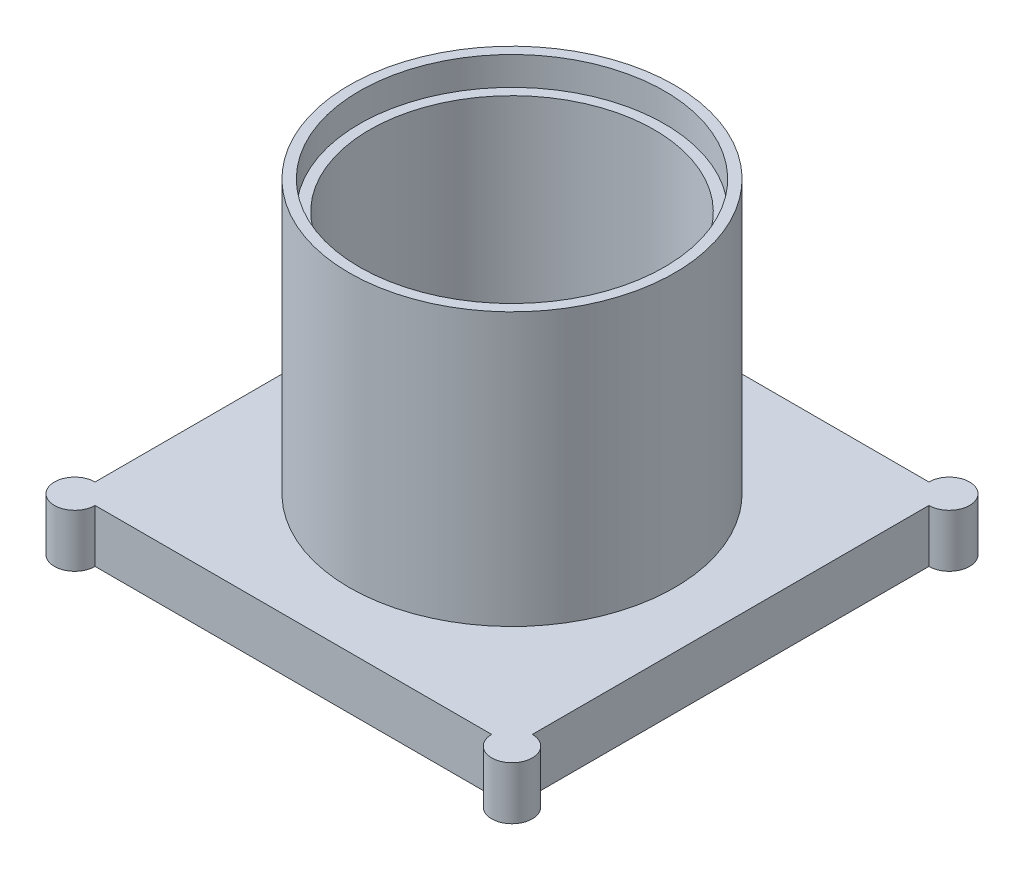
ISO-10303-21;
HEADER;
FILE_DESCRIPTION(('STEP AP214'),'2;1');
FILE_NAME('part.step','',(''),(''),'','','');
FILE_SCHEMA(('AUTOMOTIVE_DESIGN { 1 0 10303 214 1 1 1 1 }'));
ENDSEC;
DATA;
#1=APPLICATION_CONTEXT('core data for automotive mechanical design processes');
#2=APPLICATION_PROTOCOL_DEFINITION('international standard','automotive_design',2000,#1);
#3=PRODUCT_CONTEXT('',#1,'mechanical');
#4=PRODUCT('Part','Part','',(#3));
#5=PRODUCT_RELATED_PRODUCT_CATEGORY('part','',(#4));
#6=PRODUCT_DEFINITION_FORMATION('','',#4);
#7=PRODUCT_DEFINITION_CONTEXT('part definition',#1,'design');
#8=PRODUCT_DEFINITION('design','',#6,#7);
#9=PRODUCT_DEFINITION_SHAPE('','',#8);
#10=(LENGTH_UNIT() NAMED_UNIT(*) SI_UNIT(.MILLI.,.METRE.));
#11=(NAMED_UNIT(*) PLANE_ANGLE_UNIT() SI_UNIT($,.RADIAN.));
#12=(NAMED_UNIT(*) SI_UNIT($,.STERADIAN.) SOLID_ANGLE_UNIT());
#13=UNCERTAINTY_MEASURE_WITH_UNIT(LENGTH_MEASURE(1.E-05),#10,'distance_accuracy_value','');
#14=(GEOMETRIC_REPRESENTATION_CONTEXT(3) GLOBAL_UNCERTAINTY_ASSIGNED_CONTEXT((#13)) GLOBAL_UNIT_ASSIGNED_CONTEXT((#10,
#11,#12)) REPRESENTATION_CONTEXT('',''));
#15=CARTESIAN_POINT('',(0.,0.,0.));
#16=DIRECTION('',(0.,0.,1.));
#17=DIRECTION('',(1.,0.,0.));
#18=AXIS2_PLACEMENT_3D('',#15,#16,#17);
#19=CARTESIAN_POINT('',(108.086576188512,26.,0.));
#20=DIRECTION('',(1.,0.,0.));
#21=DIRECTION('',(0.,0.,-1.));
#22=AXIS2_PLACEMENT_3D('',#19,#20,#21);
#23=PLANE('',#22);
#24=DIRECTION('',(0.,0.,1.));
#25=VECTOR('',#24,1.);
#26=CARTESIAN_POINT('',(108.086576188512,0.,0.));
#27=LINE('',#26,#25);
#28=CARTESIAN_POINT('',(108.086576188512,0.,-65.1697344960939));
#29=VERTEX_POINT('',#28);
#30=CARTESIAN_POINT('',(108.086576188512,0.,129.830265503906));
#31=VERTEX_POINT('',#30);
#32=EDGE_CURVE('E148',#29,#31,#27,.T.);
#33=ORIENTED_EDGE('',*,*,#32,.F.);
#34=DIRECTION('',(0.,-1.,0.));
#35=VECTOR('',#34,1.);
#36=CARTESIAN_POINT('',(108.086576188512,26.,-65.1697344960939));
#37=LINE('',#36,#35);
#38=CARTESIAN_POINT('',(108.086576188512,26.,-65.1697344960939));
#39=VERTEX_POINT('',#38);
#40=EDGE_CURVE('E43',#39,#29,#37,.T.);
#41=ORIENTED_EDGE('',*,*,#40,.F.);
#42=DIRECTION('',(0.,0.,1.));
#43=VECTOR('',#42,1.);
#44=CARTESIAN_POINT('',(108.086576188512,26.,0.));
#45=LINE('',#44,#43);
#46=CARTESIAN_POINT('',(108.086576188512,26.,129.830265503906));
#47=VERTEX_POINT('',#46);
#48=EDGE_CURVE('E173',#39,#47,#45,.T.);
#49=ORIENTED_EDGE('',*,*,#48,.T.);
#50=DIRECTION('',(0.,-1.,0.));
#51=VECTOR('',#50,1.);
#52=CARTESIAN_POINT('',(108.086576188512,26.,129.830265503906));
#53=LINE('',#52,#51);
#54=EDGE_CURVE('E86',#47,#31,#53,.T.);
#55=ORIENTED_EDGE('',*,*,#54,.T.);
#56=EDGE_LOOP('',(#33,#41,#49,#55));
#57=FACE_BOUND('',#56,.T.);
#58=ADVANCED_FACE('F35',(#57),#23,.T.);
#59=CARTESIAN_POINT('',(108.086576188512,26.,-75.1697344960939));
#60=DIRECTION('',(0.,-1.,0.));
#61=DIRECTION('',(0.,0.,-1.));
#62=AXIS2_PLACEMENT_3D('',#59,#60,#61);
#63=CYLINDRICAL_SURFACE('',#62,9.99999999999999);
#64=CARTESIAN_POINT('',(108.086576188512,0.,-75.1697344960939));
#65=DIRECTION('',(0.,1.,0.));
#66=DIRECTION('',(0.,0.,1.));
#67=AXIS2_PLACEMENT_3D('',#64,#65,#66);
#68=CIRCLE('',#67,9.99999999999999);
#69=CARTESIAN_POINT('',(98.0865761885117,0.,-75.1697344960939));
#70=VERTEX_POINT('',#69);
#71=EDGE_CURVE('E143',#29,#70,#68,.T.);
#72=ORIENTED_EDGE('',*,*,#71,.T.);
#73=DIRECTION('',(0.,-1.,0.));
#74=VECTOR('',#73,1.);
#75=CARTESIAN_POINT('',(98.0865761885117,26.,-75.1697344960939));
#76=LINE('',#75,#74);
#77=CARTESIAN_POINT('',(98.0865761885117,26.,-75.1697344960939));
#78=VERTEX_POINT('',#77);
#79=EDGE_CURVE('E137',#78,#70,#76,.T.);
#80=ORIENTED_EDGE('',*,*,#79,.F.);
#81=CARTESIAN_POINT('',(108.086576188512,26.,-75.1697344960939));
#82=DIRECTION('',(0.,1.,0.));
#83=DIRECTION('',(0.,0.,1.));
#84=AXIS2_PLACEMENT_3D('',#81,#82,#83);
#85=CIRCLE('',#84,9.99999999999999);
#86=EDGE_CURVE('E145',#39,#78,#85,.T.);
#87=ORIENTED_EDGE('',*,*,#86,.F.);
#88=ORIENTED_EDGE('',*,*,#40,.T.);
#89=EDGE_LOOP('',(#72,#80,#87,#88));
#90=FACE_BOUND('',#89,.T.);
#91=ADVANCED_FACE('F141',(#90),#63,.T.);
#92=CARTESIAN_POINT('',(0.,26.,-75.1697344960939));
#93=DIRECTION('',(0.,0.,-1.));
#94=DIRECTION('',(-1.,0.,0.));
#95=AXIS2_PLACEMENT_3D('',#92,#93,#94);
#96=PLANE('',#95);
#97=DIRECTION('',(1.,0.,0.));
#98=VECTOR('',#97,1.);
#99=CARTESIAN_POINT('',(0.,0.,-75.1697344960939));
#100=LINE('',#99,#98);
#101=CARTESIAN_POINT('',(-96.9134238114883,0.,-75.1697344960939));
#102=VERTEX_POINT('',#101);
#103=EDGE_CURVE('E151',#102,#70,#100,.T.);
#104=ORIENTED_EDGE('',*,*,#103,.F.);
#105=DIRECTION('',(0.,-1.,0.));
#106=VECTOR('',#105,1.);
#107=CARTESIAN_POINT('',(-96.9134238114883,26.,-75.1697344960939));
#108=LINE('',#107,#106);
#109=CARTESIAN_POINT('',(-96.9134238114883,26.,-75.1697344960939));
#110=VERTEX_POINT('',#109);
#111=EDGE_CURVE('E135',#110,#102,#108,.T.);
#112=ORIENTED_EDGE('',*,*,#111,.F.);
#113=DIRECTION('',(1.,0.,0.));
#114=VECTOR('',#113,1.);
#115=CARTESIAN_POINT('',(0.,26.,-75.1697344960939));
#116=LINE('',#115,#114);
#117=EDGE_CURVE('E181',#110,#78,#116,.T.);
#118=ORIENTED_EDGE('',*,*,#117,.T.);
#119=ORIENTED_EDGE('',*,*,#79,.T.);
#120=EDGE_LOOP('',(#104,#112,#118,#119));
#121=FACE_BOUND('',#120,.T.);
#122=ADVANCED_FACE('F194',(#121),#96,.T.);
#123=CARTESIAN_POINT('',(-106.913423811488,26.,-75.1697344960939));
#124=DIRECTION('',(0.,-1.,0.));
#125=DIRECTION('',(0.,0.,-1.));
#126=AXIS2_PLACEMENT_3D('',#123,#124,#125);
#127=CYLINDRICAL_SURFACE('',#126,9.99999999999999);
#128=CARTESIAN_POINT('',(-106.913423811488,0.,-75.1697344960939));
#129=DIRECTION('',(0.,1.,0.));
#130=DIRECTION('',(0.,0.,1.));
#131=AXIS2_PLACEMENT_3D('',#128,#129,#130);
#132=CIRCLE('',#131,9.99999999999999);
#133=CARTESIAN_POINT('',(-106.913423811488,0.,-65.1697344960939));
#134=VERTEX_POINT('',#133);
#135=EDGE_CURVE('E161',#102,#134,#132,.T.);
#136=ORIENTED_EDGE('',*,*,#135,.T.);
#137=DIRECTION('',(0.,-1.,0.));
#138=VECTOR('',#137,1.);
#139=CARTESIAN_POINT('',(-106.913423811488,26.,-65.1697344960939));
#140=LINE('',#139,#138);
#141=CARTESIAN_POINT('',(-106.913423811488,26.,-65.1697344960939));
#142=VERTEX_POINT('',#141);
#143=EDGE_CURVE('E128',#142,#134,#140,.T.);
#144=ORIENTED_EDGE('',*,*,#143,.F.);
#145=CARTESIAN_POINT('',(-106.913423811488,26.,-75.1697344960939));
#146=DIRECTION('',(0.,1.,0.));
#147=DIRECTION('',(0.,0.,1.));
#148=AXIS2_PLACEMENT_3D('',#145,#146,#147);
#149=CIRCLE('',#148,9.99999999999999);
#150=EDGE_CURVE('E184',#110,#142,#149,.T.);
#151=ORIENTED_EDGE('',*,*,#150,.F.);
#152=ORIENTED_EDGE('',*,*,#111,.T.);
#153=EDGE_LOOP('',(#136,#144,#151,#152));
#154=FACE_BOUND('',#153,.T.);
#155=ADVANCED_FACE('F190',(#154),#127,.T.);
#156=CARTESIAN_POINT('',(-106.913423811488,26.,0.));
#157=DIRECTION('',(1.,0.,0.));
#158=DIRECTION('',(0.,0.,-1.));
#159=AXIS2_PLACEMENT_3D('',#156,#157,#158);
#160=PLANE('',#159);
#161=DIRECTION('',(0.,0.,1.));
#162=VECTOR('',#161,1.);
#163=CARTESIAN_POINT('',(-106.913423811488,0.,0.));
#164=LINE('',#163,#162);
#165=CARTESIAN_POINT('',(-106.913423811488,0.,129.830265503906));
#166=VERTEX_POINT('',#165);
#167=EDGE_CURVE('E164',#134,#166,#164,.T.);
#168=ORIENTED_EDGE('',*,*,#167,.T.);
#169=DIRECTION('',(0.,-1.,0.));
#170=VECTOR('',#169,1.);
#171=CARTESIAN_POINT('',(-106.913423811488,26.,129.830265503906));
#172=LINE('',#171,#170);
#173=CARTESIAN_POINT('',(-106.913423811488,26.,129.830265503906));
#174=VERTEX_POINT('',#173);
#175=EDGE_CURVE('E126',#174,#166,#172,.T.);
#176=ORIENTED_EDGE('',*,*,#175,.F.);
#177=DIRECTION('',(0.,0.,1.));
#178=VECTOR('',#177,1.);
#179=CARTESIAN_POINT('',(-106.913423811488,26.,0.));
#180=LINE('',#179,#178);
#181=EDGE_CURVE('E119',#142,#174,#180,.T.);
#182=ORIENTED_EDGE('',*,*,#181,.F.);
#183=ORIENTED_EDGE('',*,*,#143,.T.);
#184=EDGE_LOOP('',(#168,#176,#182,#183));
#185=FACE_BOUND('',#184,.T.);
#186=ADVANCED_FACE('F192',(#185),#160,.F.);
#187=CARTESIAN_POINT('',(-106.913423811488,26.,139.830265503906));
#188=DIRECTION('',(0.,-1.,0.));
#189=DIRECTION('',(0.,0.,-1.));
#190=AXIS2_PLACEMENT_3D('',#187,#188,#189);
#191=CYLINDRICAL_SURFACE('',#190,10.);
#192=CARTESIAN_POINT('',(-106.913423811488,0.,139.830265503906));
#193=DIRECTION('',(0.,1.,0.));
#194=DIRECTION('',(0.,0.,1.));
#195=AXIS2_PLACEMENT_3D('',#192,#193,#194);
#196=CIRCLE('',#195,10.);
#197=CARTESIAN_POINT('',(-96.9134238114883,0.,139.830265503906));
#198=VERTEX_POINT('',#197);
#199=EDGE_CURVE('E125',#166,#198,#196,.T.);
#200=ORIENTED_EDGE('',*,*,#199,.T.);
#201=DIRECTION('',(0.,-1.,0.));
#202=VECTOR('',#201,1.);
#203=CARTESIAN_POINT('',(-96.9134238114883,26.,139.830265503906));
#204=LINE('',#203,#202);
#205=CARTESIAN_POINT('',(-96.9134238114883,26.,139.830265503906));
#206=VERTEX_POINT('',#205);
#207=EDGE_CURVE('E111',#206,#198,#204,.T.);
#208=ORIENTED_EDGE('',*,*,#207,.F.);
#209=CARTESIAN_POINT('',(-106.913423811488,26.,139.830265503906));
#210=DIRECTION('',(0.,1.,0.));
#211=DIRECTION('',(0.,0.,1.));
#212=AXIS2_PLACEMENT_3D('',#209,#210,#211);
#213=CIRCLE('',#212,10.);
#214=EDGE_CURVE('E114',#174,#206,#213,.T.);
#215=ORIENTED_EDGE('',*,*,#214,.F.);
#216=ORIENTED_EDGE('',*,*,#175,.T.);
#217=EDGE_LOOP('',(#200,#208,#215,#216));
#218=FACE_BOUND('',#217,.T.);
#219=ADVANCED_FACE('F124',(#218),#191,.T.);
#220=CARTESIAN_POINT('',(0.,26.,139.830265503906));
#221=DIRECTION('',(0.,0.,-1.));
#222=DIRECTION('',(-1.,0.,0.));
#223=AXIS2_PLACEMENT_3D('',#220,#221,#222);
#224=PLANE('',#223);
#225=DIRECTION('',(1.,0.,0.));
#226=VECTOR('',#225,1.);
#227=CARTESIAN_POINT('',(0.,0.,139.830265503906));
#228=LINE('',#227,#226);
#229=CARTESIAN_POINT('',(98.0865761885117,0.,139.830265503906));
#230=VERTEX_POINT('',#229);
#231=EDGE_CURVE('E168',#198,#230,#228,.T.);
#232=ORIENTED_EDGE('',*,*,#231,.T.);
#233=DIRECTION('',(0.,-1.,0.));
#234=VECTOR('',#233,1.);
#235=CARTESIAN_POINT('',(98.0865761885117,26.,139.830265503906));
#236=LINE('',#235,#234);
#237=CARTESIAN_POINT('',(98.0865761885117,26.,139.830265503906));
#238=VERTEX_POINT('',#237);
#239=EDGE_CURVE('E113',#238,#230,#236,.T.);
#240=ORIENTED_EDGE('',*,*,#239,.F.);
#241=DIRECTION('',(1.,0.,0.));
#242=VECTOR('',#241,1.);
#243=CARTESIAN_POINT('',(0.,26.,139.830265503906));
#244=LINE('',#243,#242);
#245=EDGE_CURVE('E106',#206,#238,#244,.T.);
#246=ORIENTED_EDGE('',*,*,#245,.F.);
#247=ORIENTED_EDGE('',*,*,#207,.T.);
#248=EDGE_LOOP('',(#232,#240,#246,#247));
#249=FACE_BOUND('',#248,.T.);
#250=ADVANCED_FACE('F109',(#249),#224,.F.);
#251=CARTESIAN_POINT('',(108.086576188512,26.,139.830265503906));
#252=DIRECTION('',(0.,-1.,0.));
#253=DIRECTION('',(0.,0.,-1.));
#254=AXIS2_PLACEMENT_3D('',#251,#252,#253);
#255=CYLINDRICAL_SURFACE('',#254,10.);
#256=CARTESIAN_POINT('',(108.086576188512,0.,139.830265503906));
#257=DIRECTION('',(0.,1.,0.));
#258=DIRECTION('',(0.,0.,1.));
#259=AXIS2_PLACEMENT_3D('',#256,#257,#258);
#260=CIRCLE('',#259,10.);
#261=EDGE_CURVE('E79',#230,#31,#260,.T.);
#262=ORIENTED_EDGE('',*,*,#261,.T.);
#263=ORIENTED_EDGE('',*,*,#54,.F.);
#264=CARTESIAN_POINT('',(108.086576188512,26.,139.830265503906));
#265=DIRECTION('',(0.,1.,0.));
#266=DIRECTION('',(0.,0.,1.));
#267=AXIS2_PLACEMENT_3D('',#264,#265,#266);
#268=CIRCLE('',#267,10.);
#269=EDGE_CURVE('E51',#238,#47,#268,.T.);
#270=ORIENTED_EDGE('',*,*,#269,.F.);
#271=ORIENTED_EDGE('',*,*,#239,.T.);
#272=EDGE_LOOP('',(#262,#263,#270,#271));
#273=FACE_BOUND('',#272,.T.);
#274=ADVANCED_FACE('F244',(#273),#255,.T.);
#275=CARTESIAN_POINT('',(0.,26.,0.));
#276=DIRECTION('',(0.,1.,0.));
#277=DIRECTION('',(0.,0.,1.));
#278=AXIS2_PLACEMENT_3D('',#275,#276,#277);
#279=PLANE('',#278);
#280=CARTESIAN_POINT('',(0.586576188511684,26.,32.3302655039061));
#281=DIRECTION('',(0.,1.,0.));
#282=DIRECTION('',(0.,0.,1.));
#283=AXIS2_PLACEMENT_3D('',#280,#281,#282);
#284=CIRCLE('',#283,80.);
#285=CARTESIAN_POINT('',(0.586576188511684,26.,112.330265503906));
#286=VERTEX_POINT('',#285);
#287=EDGE_CURVE('E170',#286,#286,#284,.T.);
#288=ORIENTED_EDGE('',*,*,#287,.F.);
#289=EDGE_LOOP('',(#288));
#290=FACE_BOUND('',#289,.T.);
#291=ORIENTED_EDGE('',*,*,#48,.F.);
#292=ORIENTED_EDGE('',*,*,#86,.T.);
#293=ORIENTED_EDGE('',*,*,#117,.F.);
#294=ORIENTED_EDGE('',*,*,#150,.T.);
#295=ORIENTED_EDGE('',*,*,#181,.T.);
#296=ORIENTED_EDGE('',*,*,#214,.T.);
#297=ORIENTED_EDGE('',*,*,#245,.T.);
#298=ORIENTED_EDGE('',*,*,#269,.T.);
#299=EDGE_LOOP('',(#291,#292,#293,#294,#295,#296,#297,#298));
#300=FACE_BOUND('',#299,.T.);
#301=ADVANCED_FACE('F117',(#290,#300),#279,.T.);
#302=CARTESIAN_POINT('',(0.,0.,0.));
#303=DIRECTION('',(0.,1.,0.));
#304=DIRECTION('',(0.,0.,1.));
#305=AXIS2_PLACEMENT_3D('',#302,#303,#304);
#306=PLANE('',#305);
#307=ORIENTED_EDGE('',*,*,#32,.T.);
#308=ORIENTED_EDGE('',*,*,#261,.F.);
#309=ORIENTED_EDGE('',*,*,#231,.F.);
#310=ORIENTED_EDGE('',*,*,#199,.F.);
#311=ORIENTED_EDGE('',*,*,#167,.F.);
#312=ORIENTED_EDGE('',*,*,#135,.F.);
#313=ORIENTED_EDGE('',*,*,#103,.T.);
#314=ORIENTED_EDGE('',*,*,#71,.F.);
#315=EDGE_LOOP('',(#307,#308,#309,#310,#311,#312,#313,#314));
#316=FACE_BOUND('',#315,.T.);
#317=CARTESIAN_POINT('',(0.586576188511684,0.,32.3302655039061));
#318=DIRECTION('',(0.,1.,0.));
#319=DIRECTION('',(0.,0.,1.));
#320=AXIS2_PLACEMENT_3D('',#317,#318,#319);
#321=CIRCLE('',#320,70.);
#322=CARTESIAN_POINT('',(0.586576188511684,0.,102.330265503906));
#323=VERTEX_POINT('',#322);
#324=EDGE_CURVE('E332',#323,#323,#321,.T.);
#325=ORIENTED_EDGE('',*,*,#324,.T.);
#326=EDGE_LOOP('',(#325));
#327=FACE_BOUND('',#326,.T.);
#328=ADVANCED_FACE('F146',(#316,#327),#306,.F.);
#329=CARTESIAN_POINT('',(0.586576188511684,160.,32.3302655039061));
#330=DIRECTION('',(0.,-1.,0.));
#331=DIRECTION('',(0.,0.,-1.));
#332=AXIS2_PLACEMENT_3D('',#329,#330,#331);
#333=CYLINDRICAL_SURFACE('',#332,75.);
#334=CARTESIAN_POINT('',(0.586576188511684,146.,32.3302655039061));
#335=DIRECTION('',(0.,1.,0.));
#336=DIRECTION('',(0.,0.,1.));
#337=AXIS2_PLACEMENT_3D('',#334,#335,#336);
#338=CIRCLE('',#337,75.);
#339=CARTESIAN_POINT('',(0.586576188511684,146.,107.330265503906));
#340=VERTEX_POINT('',#339);
#341=EDGE_CURVE('E11',#340,#340,#338,.T.);
#342=ORIENTED_EDGE('',*,*,#341,.F.);
#343=EDGE_LOOP('',(#342));
#344=FACE_BOUND('',#343,.T.);
#345=CARTESIAN_POINT('',(0.586576188511684,160.,32.3302655039061));
#346=DIRECTION('',(0.,1.,0.));
#347=DIRECTION('',(0.,0.,1.));
#348=AXIS2_PLACEMENT_3D('',#345,#346,#347);
#349=CIRCLE('',#348,75.);
#350=CARTESIAN_POINT('',(0.586576188511684,160.,107.330265503906));
#351=VERTEX_POINT('',#350);
#352=EDGE_CURVE('E156',#351,#351,#349,.T.);
#353=ORIENTED_EDGE('',*,*,#352,.T.);
#354=EDGE_LOOP('',(#353));
#355=FACE_BOUND('',#354,.T.);
#356=ADVANCED_FACE('F274',(#344,#355),#333,.F.);
#357=CARTESIAN_POINT('',(0.586576188511684,160.,32.3302655039061));
#358=DIRECTION('',(0.,-1.,0.));
#359=DIRECTION('',(0.,0.,-1.));
#360=AXIS2_PLACEMENT_3D('',#357,#358,#359);
#361=CYLINDRICAL_SURFACE('',#360,80.);
#362=ORIENTED_EDGE('',*,*,#287,.T.);
#363=EDGE_LOOP('',(#362));
#364=FACE_BOUND('',#363,.T.);
#365=CARTESIAN_POINT('',(0.586576188511684,160.,32.3302655039061));
#366=DIRECTION('',(0.,1.,0.));
#367=DIRECTION('',(0.,0.,1.));
#368=AXIS2_PLACEMENT_3D('',#365,#366,#367);
#369=CIRCLE('',#368,80.);
#370=CARTESIAN_POINT('',(0.586576188511684,160.,112.330265503906));
#371=VERTEX_POINT('',#370);
#372=EDGE_CURVE('E153',#371,#371,#369,.T.);
#373=ORIENTED_EDGE('',*,*,#372,.F.);
#374=EDGE_LOOP('',(#373));
#375=FACE_BOUND('',#374,.T.);
#376=ADVANCED_FACE('F268',(#364,#375),#361,.T.);
#377=CARTESIAN_POINT('',(0.,160.,0.));
#378=DIRECTION('',(0.,1.,0.));
#379=DIRECTION('',(0.,0.,1.));
#380=AXIS2_PLACEMENT_3D('',#377,#378,#379);
#381=PLANE('',#380);
#382=ORIENTED_EDGE('',*,*,#352,.F.);
#383=EDGE_LOOP('',(#382));
#384=FACE_BOUND('',#383,.T.);
#385=ORIENTED_EDGE('',*,*,#372,.T.);
#386=EDGE_LOOP('',(#385));
#387=FACE_BOUND('',#386,.T.);
#388=ADVANCED_FACE('F273',(#384,#387),#381,.T.);
#389=CARTESIAN_POINT('',(0.586576188511684,146.,32.3302655039061));
#390=DIRECTION('',(0.,-1.,0.));
#391=DIRECTION('',(0.,0.,-1.));
#392=AXIS2_PLACEMENT_3D('',#389,#390,#391);
#393=CYLINDRICAL_SURFACE('',#392,70.);
#394=CARTESIAN_POINT('',(0.586576188511684,146.,32.3302655039061));
#395=DIRECTION('',(0.,1.,0.));
#396=DIRECTION('',(0.,0.,1.));
#397=AXIS2_PLACEMENT_3D('',#394,#395,#396);
#398=CIRCLE('',#397,70.);
#399=CARTESIAN_POINT('',(0.586576188511684,146.,102.330265503906));
#400=VERTEX_POINT('',#399);
#401=EDGE_CURVE('E327',#400,#400,#398,.T.);
#402=ORIENTED_EDGE('',*,*,#401,.T.);
#403=EDGE_LOOP('',(#402));
#404=FACE_BOUND('',#403,.T.);
#405=ORIENTED_EDGE('',*,*,#324,.F.);
#406=EDGE_LOOP('',(#405));
#407=FACE_BOUND('',#406,.T.);
#408=ADVANCED_FACE('F285',(#404,#407),#393,.F.);
#409=CARTESIAN_POINT('',(0.,146.,0.));
#410=DIRECTION('',(0.,1.,0.));
#411=DIRECTION('',(0.,0.,1.));
#412=AXIS2_PLACEMENT_3D('',#409,#410,#411);
#413=PLANE('',#412);
#414=ORIENTED_EDGE('',*,*,#401,.F.);
#415=EDGE_LOOP('',(#414));
#416=FACE_BOUND('',#415,.T.);
#417=ORIENTED_EDGE('',*,*,#341,.T.);
#418=EDGE_LOOP('',(#417));
#419=FACE_BOUND('',#418,.T.);
#420=ADVANCED_FACE('F310',(#416,#419),#413,.T.);
#421=CLOSED_SHELL('',(#58,#91,#122,#155,#186,#219,#250,#274,#301,#328,#356,#376,#388,#408,#420));
#422=MANIFOLD_SOLID_BREP('B2',#421);
#423=ADVANCED_BREP_SHAPE_REPRESENTATION('',(#18,#422),#14);
#424=SHAPE_DEFINITION_REPRESENTATION(#9,#423);
ENDSEC;
END-ISO-10303-21;
